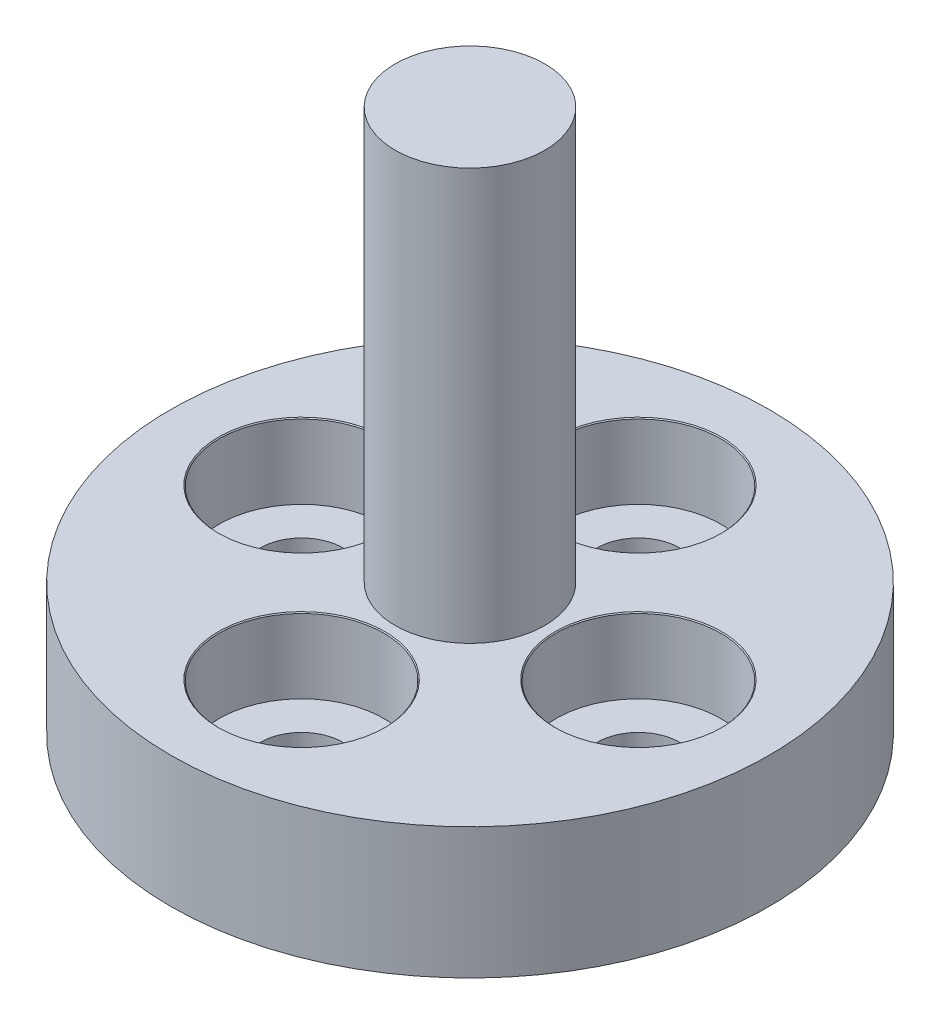
ISO-10303-21;
HEADER;
FILE_DESCRIPTION(('STEP AP214'),'2;1');
FILE_NAME('part.step','',(''),(''),'','','');
FILE_SCHEMA(('AUTOMOTIVE_DESIGN { 1 0 10303 214 1 1 1 1 }'));
ENDSEC;
DATA;
#1=APPLICATION_CONTEXT('core data for automotive mechanical design processes');
#2=APPLICATION_PROTOCOL_DEFINITION('international standard','automotive_design',2000,#1);
#3=PRODUCT_CONTEXT('',#1,'mechanical');
#4=PRODUCT('Part','Part','',(#3));
#5=PRODUCT_RELATED_PRODUCT_CATEGORY('part','',(#4));
#6=PRODUCT_DEFINITION_FORMATION('','',#4);
#7=PRODUCT_DEFINITION_CONTEXT('part definition',#1,'design');
#8=PRODUCT_DEFINITION('design','',#6,#7);
#9=PRODUCT_DEFINITION_SHAPE('','',#8);
#10=(LENGTH_UNIT() NAMED_UNIT(*) SI_UNIT(.MILLI.,.METRE.));
#11=(NAMED_UNIT(*) PLANE_ANGLE_UNIT() SI_UNIT($,.RADIAN.));
#12=(NAMED_UNIT(*) SI_UNIT($,.STERADIAN.) SOLID_ANGLE_UNIT());
#13=UNCERTAINTY_MEASURE_WITH_UNIT(LENGTH_MEASURE(1.E-05),#10,'distance_accuracy_value','');
#14=(GEOMETRIC_REPRESENTATION_CONTEXT(3) GLOBAL_UNCERTAINTY_ASSIGNED_CONTEXT((#13)) GLOBAL_UNIT_ASSIGNED_CONTEXT((#10,
#11,#12)) REPRESENTATION_CONTEXT('',''));
#15=CARTESIAN_POINT('',(0.,0.,0.));
#16=DIRECTION('',(0.,0.,1.));
#17=DIRECTION('',(1.,0.,0.));
#18=AXIS2_PLACEMENT_3D('',#15,#16,#17);
#19=CARTESIAN_POINT('',(8.,0.,0.));
#20=DIRECTION('',(0.,-1.,0.));
#21=DIRECTION('',(0.,0.,-1.));
#22=AXIS2_PLACEMENT_3D('',#19,#20,#21);
#23=PLANE('',#22);
#24=CARTESIAN_POINT('',(0.,0.,-4.5));
#25=DIRECTION('',(0.,1.,0.));
#26=DIRECTION('',(0.,0.,1.));
#27=AXIS2_PLACEMENT_3D('',#24,#25,#26);
#28=CIRCLE('',#27,1.1);
#29=CARTESIAN_POINT('',(0.,0.,-3.4));
#30=VERTEX_POINT('',#29);
#31=EDGE_CURVE('E124',#30,#30,#28,.T.);
#32=ORIENTED_EDGE('',*,*,#31,.T.);
#33=EDGE_LOOP('',(#32));
#34=FACE_BOUND('',#33,.T.);
#35=CARTESIAN_POINT('',(4.5,0.,0.));
#36=DIRECTION('',(0.,1.,0.));
#37=DIRECTION('',(0.,0.,1.));
#38=AXIS2_PLACEMENT_3D('',#35,#36,#37);
#39=CIRCLE('',#38,1.1);
#40=CARTESIAN_POINT('',(4.5,0.,1.1));
#41=VERTEX_POINT('',#40);
#42=EDGE_CURVE('E104',#41,#41,#39,.T.);
#43=ORIENTED_EDGE('',*,*,#42,.T.);
#44=EDGE_LOOP('',(#43));
#45=FACE_BOUND('',#44,.T.);
#46=CARTESIAN_POINT('',(0.,0.,4.5));
#47=DIRECTION('',(0.,1.,0.));
#48=DIRECTION('',(0.,0.,1.));
#49=AXIS2_PLACEMENT_3D('',#46,#47,#48);
#50=CIRCLE('',#49,1.1);
#51=CARTESIAN_POINT('',(0.,0.,5.6));
#52=VERTEX_POINT('',#51);
#53=EDGE_CURVE('E84',#52,#52,#50,.T.);
#54=ORIENTED_EDGE('',*,*,#53,.T.);
#55=EDGE_LOOP('',(#54));
#56=FACE_BOUND('',#55,.T.);
#57=CARTESIAN_POINT('',(-4.5,0.,0.));
#58=DIRECTION('',(0.,1.,0.));
#59=DIRECTION('',(0.,0.,1.));
#60=AXIS2_PLACEMENT_3D('',#57,#58,#59);
#61=CIRCLE('',#60,1.1);
#62=CARTESIAN_POINT('',(-4.5,0.,1.1));
#63=VERTEX_POINT('',#62);
#64=EDGE_CURVE('E64',#63,#63,#61,.T.);
#65=ORIENTED_EDGE('',*,*,#64,.T.);
#66=EDGE_LOOP('',(#65));
#67=FACE_BOUND('',#66,.T.);
#68=CARTESIAN_POINT('',(0.,0.,0.));
#69=DIRECTION('',(0.,-1.,0.));
#70=DIRECTION('',(0.,0.,-1.));
#71=AXIS2_PLACEMENT_3D('',#68,#69,#70);
#72=CIRCLE('',#71,8.);
#73=CARTESIAN_POINT('',(0.,0.,-8.));
#74=VERTEX_POINT('',#73);
#75=EDGE_CURVE('E58',#74,#74,#72,.T.);
#76=ORIENTED_EDGE('',*,*,#75,.T.);
#77=EDGE_LOOP('',(#76));
#78=FACE_BOUND('',#77,.T.);
#79=ADVANCED_FACE('F41',(#34,#45,#56,#67,#78),#23,.T.);
#80=CARTESIAN_POINT('',(0.,14.5,0.));
#81=DIRECTION('',(0.,1.,0.));
#82=DIRECTION('',(0.,0.,1.));
#83=AXIS2_PLACEMENT_3D('',#80,#81,#82);
#84=PLANE('',#83);
#85=CARTESIAN_POINT('',(0.,14.5,0.));
#86=DIRECTION('',(0.,-1.,0.));
#87=DIRECTION('',(0.,0.,-1.));
#88=AXIS2_PLACEMENT_3D('',#85,#86,#87);
#89=CIRCLE('',#88,2.);
#90=CARTESIAN_POINT('',(0.,14.5,-2.));
#91=VERTEX_POINT('',#90);
#92=EDGE_CURVE('E10',#91,#91,#89,.T.);
#93=ORIENTED_EDGE('',*,*,#92,.F.);
#94=EDGE_LOOP('',(#93));
#95=FACE_BOUND('',#94,.T.);
#96=ADVANCED_FACE('F168',(#95),#84,.T.);
#97=CARTESIAN_POINT('',(0.,0.,0.));
#98=DIRECTION('',(0.,-1.,0.));
#99=DIRECTION('',(0.,0.,-1.));
#100=AXIS2_PLACEMENT_3D('',#97,#98,#99);
#101=CYLINDRICAL_SURFACE('',#100,2.);
#102=ORIENTED_EDGE('',*,*,#92,.T.);
#103=EDGE_LOOP('',(#102));
#104=FACE_BOUND('',#103,.T.);
#105=CARTESIAN_POINT('',(0.,3.5,0.));
#106=DIRECTION('',(0.,-1.,0.));
#107=DIRECTION('',(0.,0.,-1.));
#108=AXIS2_PLACEMENT_3D('',#105,#106,#107);
#109=CIRCLE('',#108,2.);
#110=CARTESIAN_POINT('',(0.,3.5,-2.));
#111=VERTEX_POINT('',#110);
#112=EDGE_CURVE('E48',#111,#111,#109,.T.);
#113=ORIENTED_EDGE('',*,*,#112,.F.);
#114=EDGE_LOOP('',(#113));
#115=FACE_BOUND('',#114,.T.);
#116=ADVANCED_FACE('F151',(#104,#115),#101,.T.);
#117=CARTESIAN_POINT('',(2.,3.5,0.));
#118=DIRECTION('',(0.,1.,0.));
#119=DIRECTION('',(0.,0.,1.));
#120=AXIS2_PLACEMENT_3D('',#117,#118,#119);
#121=PLANE('',#120);
#122=CARTESIAN_POINT('',(0.,3.5,-4.5));
#123=DIRECTION('',(0.,1.,0.));
#124=DIRECTION('',(0.,0.,1.));
#125=AXIS2_PLACEMENT_3D('',#122,#123,#124);
#126=CIRCLE('',#125,2.225);
#127=CARTESIAN_POINT('',(0.,3.5,-2.275));
#128=VERTEX_POINT('',#127);
#129=EDGE_CURVE('E140',#128,#128,#126,.T.);
#130=ORIENTED_EDGE('',*,*,#129,.F.);
#131=EDGE_LOOP('',(#130));
#132=FACE_BOUND('',#131,.T.);
#133=CARTESIAN_POINT('',(4.5,3.5,0.));
#134=DIRECTION('',(0.,1.,0.));
#135=DIRECTION('',(0.,0.,1.));
#136=AXIS2_PLACEMENT_3D('',#133,#134,#135);
#137=CIRCLE('',#136,2.225);
#138=CARTESIAN_POINT('',(4.5,3.5,2.225));
#139=VERTEX_POINT('',#138);
#140=EDGE_CURVE('E120',#139,#139,#137,.T.);
#141=ORIENTED_EDGE('',*,*,#140,.F.);
#142=EDGE_LOOP('',(#141));
#143=FACE_BOUND('',#142,.T.);
#144=CARTESIAN_POINT('',(0.,3.5,4.5));
#145=DIRECTION('',(0.,1.,0.));
#146=DIRECTION('',(0.,0.,1.));
#147=AXIS2_PLACEMENT_3D('',#144,#145,#146);
#148=CIRCLE('',#147,2.225);
#149=CARTESIAN_POINT('',(0.,3.5,6.725));
#150=VERTEX_POINT('',#149);
#151=EDGE_CURVE('E100',#150,#150,#148,.T.);
#152=ORIENTED_EDGE('',*,*,#151,.F.);
#153=EDGE_LOOP('',(#152));
#154=FACE_BOUND('',#153,.T.);
#155=CARTESIAN_POINT('',(-4.5,3.5,0.));
#156=DIRECTION('',(0.,1.,0.));
#157=DIRECTION('',(0.,0.,1.));
#158=AXIS2_PLACEMENT_3D('',#155,#156,#157);
#159=CIRCLE('',#158,2.225);
#160=CARTESIAN_POINT('',(-4.5,3.5,2.225));
#161=VERTEX_POINT('',#160);
#162=EDGE_CURVE('E80',#161,#161,#159,.T.);
#163=ORIENTED_EDGE('',*,*,#162,.F.);
#164=EDGE_LOOP('',(#163));
#165=FACE_BOUND('',#164,.T.);
#166=ORIENTED_EDGE('',*,*,#112,.T.);
#167=EDGE_LOOP('',(#166));
#168=FACE_BOUND('',#167,.T.);
#169=CARTESIAN_POINT('',(0.,3.5,0.));
#170=DIRECTION('',(0.,-1.,0.));
#171=DIRECTION('',(0.,0.,-1.));
#172=AXIS2_PLACEMENT_3D('',#169,#170,#171);
#173=CIRCLE('',#172,8.);
#174=CARTESIAN_POINT('',(0.,3.5,-8.));
#175=VERTEX_POINT('',#174);
#176=EDGE_CURVE('E53',#175,#175,#173,.T.);
#177=ORIENTED_EDGE('',*,*,#176,.F.);
#178=EDGE_LOOP('',(#177));
#179=FACE_BOUND('',#178,.T.);
#180=ADVANCED_FACE('F147',(#132,#143,#154,#165,#168,#179),#121,.T.);
#181=CARTESIAN_POINT('',(0.,0.,0.));
#182=DIRECTION('',(0.,-1.,0.));
#183=DIRECTION('',(0.,0.,-1.));
#184=AXIS2_PLACEMENT_3D('',#181,#182,#183);
#185=CYLINDRICAL_SURFACE('',#184,8.);
#186=ORIENTED_EDGE('',*,*,#176,.T.);
#187=EDGE_LOOP('',(#186));
#188=FACE_BOUND('',#187,.T.);
#189=ORIENTED_EDGE('',*,*,#75,.F.);
#190=EDGE_LOOP('',(#189));
#191=FACE_BOUND('',#190,.T.);
#192=ADVANCED_FACE('F150',(#188,#191),#185,.T.);
#193=CARTESIAN_POINT('',(-4.5,3.5,0.));
#194=DIRECTION('',(0.,1.,0.));
#195=DIRECTION('',(0.,0.,1.));
#196=AXIS2_PLACEMENT_3D('',#193,#194,#195);
#197=CYLINDRICAL_SURFACE('',#196,1.1);
#198=ORIENTED_EDGE('',*,*,#64,.F.);
#199=EDGE_LOOP('',(#198));
#200=FACE_BOUND('',#199,.T.);
#201=CARTESIAN_POINT('',(-4.5,1.5,0.));
#202=DIRECTION('',(0.,1.,0.));
#203=DIRECTION('',(0.,0.,1.));
#204=AXIS2_PLACEMENT_3D('',#201,#202,#203);
#205=CIRCLE('',#204,1.1);
#206=CARTESIAN_POINT('',(-4.5,1.5,1.1));
#207=VERTEX_POINT('',#206);
#208=EDGE_CURVE('E68',#207,#207,#205,.T.);
#209=ORIENTED_EDGE('',*,*,#208,.T.);
#210=EDGE_LOOP('',(#209));
#211=FACE_BOUND('',#210,.T.);
#212=ADVANCED_FACE('F163',(#200,#211),#197,.F.);
#213=CARTESIAN_POINT('',(-2.3,1.5,0.));
#214=DIRECTION('',(0.,-1.,0.));
#215=DIRECTION('',(0.,0.,-1.));
#216=AXIS2_PLACEMENT_3D('',#213,#214,#215);
#217=PLANE('',#216);
#218=ORIENTED_EDGE('',*,*,#208,.F.);
#219=EDGE_LOOP('',(#218));
#220=FACE_BOUND('',#219,.T.);
#221=CARTESIAN_POINT('',(-4.5,1.5,0.));
#222=DIRECTION('',(0.,1.,0.));
#223=DIRECTION('',(0.,0.,1.));
#224=AXIS2_PLACEMENT_3D('',#221,#222,#223);
#225=CIRCLE('',#224,2.2);
#226=CARTESIAN_POINT('',(-4.5,1.5,2.2));
#227=VERTEX_POINT('',#226);
#228=EDGE_CURVE('E72',#227,#227,#225,.T.);
#229=ORIENTED_EDGE('',*,*,#228,.T.);
#230=EDGE_LOOP('',(#229));
#231=FACE_BOUND('',#230,.T.);
#232=ADVANCED_FACE('F184',(#220,#231),#217,.F.);
#233=CARTESIAN_POINT('',(-4.5,3.5,0.));
#234=DIRECTION('',(0.,1.,0.));
#235=DIRECTION('',(0.,0.,1.));
#236=AXIS2_PLACEMENT_3D('',#233,#234,#235);
#237=CYLINDRICAL_SURFACE('',#236,2.2);
#238=ORIENTED_EDGE('',*,*,#228,.F.);
#239=EDGE_LOOP('',(#238));
#240=FACE_BOUND('',#239,.T.);
#241=CARTESIAN_POINT('',(-4.5,3.475,0.));
#242=DIRECTION('',(0.,1.,0.));
#243=DIRECTION('',(0.,0.,1.));
#244=AXIS2_PLACEMENT_3D('',#241,#242,#243);
#245=CIRCLE('',#244,2.2);
#246=CARTESIAN_POINT('',(-4.5,3.475,2.2));
#247=VERTEX_POINT('',#246);
#248=EDGE_CURVE('E76',#247,#247,#245,.T.);
#249=ORIENTED_EDGE('',*,*,#248,.T.);
#250=EDGE_LOOP('',(#249));
#251=FACE_BOUND('',#250,.T.);
#252=ADVANCED_FACE('F190',(#240,#251),#237,.F.);
#253=CARTESIAN_POINT('',(-4.5,3.5,0.));
#254=DIRECTION('',(0.,1.,0.));
#255=DIRECTION('',(0.,0.,1.));
#256=AXIS2_PLACEMENT_3D('',#253,#254,#255);
#257=CONICAL_SURFACE('',#256,2.225,0.785398163397405);
#258=ORIENTED_EDGE('',*,*,#248,.F.);
#259=EDGE_LOOP('',(#258));
#260=FACE_BOUND('',#259,.T.);
#261=ORIENTED_EDGE('',*,*,#162,.T.);
#262=EDGE_LOOP('',(#261));
#263=FACE_BOUND('',#262,.T.);
#264=ADVANCED_FACE('F196',(#260,#263),#257,.F.);
#265=CARTESIAN_POINT('',(0.,3.5,4.5));
#266=DIRECTION('',(0.,1.,0.));
#267=DIRECTION('',(0.,0.,1.));
#268=AXIS2_PLACEMENT_3D('',#265,#266,#267);
#269=CYLINDRICAL_SURFACE('',#268,1.1);
#270=ORIENTED_EDGE('',*,*,#53,.F.);
#271=EDGE_LOOP('',(#270));
#272=FACE_BOUND('',#271,.T.);
#273=CARTESIAN_POINT('',(0.,1.5,4.5));
#274=DIRECTION('',(0.,1.,0.));
#275=DIRECTION('',(0.,0.,1.));
#276=AXIS2_PLACEMENT_3D('',#273,#274,#275);
#277=CIRCLE('',#276,1.1);
#278=CARTESIAN_POINT('',(0.,1.5,5.6));
#279=VERTEX_POINT('',#278);
#280=EDGE_CURVE('E88',#279,#279,#277,.T.);
#281=ORIENTED_EDGE('',*,*,#280,.T.);
#282=EDGE_LOOP('',(#281));
#283=FACE_BOUND('',#282,.T.);
#284=ADVANCED_FACE('F202',(#272,#283),#269,.F.);
#285=CARTESIAN_POINT('',(2.2,1.5,4.5));
#286=DIRECTION('',(0.,-1.,0.));
#287=DIRECTION('',(0.,0.,-1.));
#288=AXIS2_PLACEMENT_3D('',#285,#286,#287);
#289=PLANE('',#288);
#290=ORIENTED_EDGE('',*,*,#280,.F.);
#291=EDGE_LOOP('',(#290));
#292=FACE_BOUND('',#291,.T.);
#293=CARTESIAN_POINT('',(0.,1.5,4.5));
#294=DIRECTION('',(0.,1.,0.));
#295=DIRECTION('',(0.,0.,1.));
#296=AXIS2_PLACEMENT_3D('',#293,#294,#295);
#297=CIRCLE('',#296,2.2);
#298=CARTESIAN_POINT('',(0.,1.5,6.7));
#299=VERTEX_POINT('',#298);
#300=EDGE_CURVE('E92',#299,#299,#297,.T.);
#301=ORIENTED_EDGE('',*,*,#300,.T.);
#302=EDGE_LOOP('',(#301));
#303=FACE_BOUND('',#302,.T.);
#304=ADVANCED_FACE('F207',(#292,#303),#289,.F.);
#305=CARTESIAN_POINT('',(0.,3.5,4.5));
#306=DIRECTION('',(0.,1.,0.));
#307=DIRECTION('',(0.,0.,1.));
#308=AXIS2_PLACEMENT_3D('',#305,#306,#307);
#309=CYLINDRICAL_SURFACE('',#308,2.2);
#310=ORIENTED_EDGE('',*,*,#300,.F.);
#311=EDGE_LOOP('',(#310));
#312=FACE_BOUND('',#311,.T.);
#313=CARTESIAN_POINT('',(0.,3.475,4.5));
#314=DIRECTION('',(0.,1.,0.));
#315=DIRECTION('',(0.,0.,1.));
#316=AXIS2_PLACEMENT_3D('',#313,#314,#315);
#317=CIRCLE('',#316,2.2);
#318=CARTESIAN_POINT('',(0.,3.475,6.7));
#319=VERTEX_POINT('',#318);
#320=EDGE_CURVE('E96',#319,#319,#317,.T.);
#321=ORIENTED_EDGE('',*,*,#320,.T.);
#322=EDGE_LOOP('',(#321));
#323=FACE_BOUND('',#322,.T.);
#324=ADVANCED_FACE('F260',(#312,#323),#309,.F.);
#325=CARTESIAN_POINT('',(0.,3.5,4.5));
#326=DIRECTION('',(0.,1.,0.));
#327=DIRECTION('',(0.,0.,1.));
#328=AXIS2_PLACEMENT_3D('',#325,#326,#327);
#329=CONICAL_SURFACE('',#328,2.225,0.785398163397405);
#330=ORIENTED_EDGE('',*,*,#320,.F.);
#331=EDGE_LOOP('',(#330));
#332=FACE_BOUND('',#331,.T.);
#333=ORIENTED_EDGE('',*,*,#151,.T.);
#334=EDGE_LOOP('',(#333));
#335=FACE_BOUND('',#334,.T.);
#336=ADVANCED_FACE('F270',(#332,#335),#329,.F.);
#337=CARTESIAN_POINT('',(4.5,3.5,0.));
#338=DIRECTION('',(0.,1.,0.));
#339=DIRECTION('',(0.,0.,1.));
#340=AXIS2_PLACEMENT_3D('',#337,#338,#339);
#341=CYLINDRICAL_SURFACE('',#340,1.1);
#342=ORIENTED_EDGE('',*,*,#42,.F.);
#343=EDGE_LOOP('',(#342));
#344=FACE_BOUND('',#343,.T.);
#345=CARTESIAN_POINT('',(4.5,1.5,0.));
#346=DIRECTION('',(0.,1.,0.));
#347=DIRECTION('',(0.,0.,1.));
#348=AXIS2_PLACEMENT_3D('',#345,#346,#347);
#349=CIRCLE('',#348,1.1);
#350=CARTESIAN_POINT('',(4.5,1.5,1.1));
#351=VERTEX_POINT('',#350);
#352=EDGE_CURVE('E108',#351,#351,#349,.T.);
#353=ORIENTED_EDGE('',*,*,#352,.T.);
#354=EDGE_LOOP('',(#353));
#355=FACE_BOUND('',#354,.T.);
#356=ADVANCED_FACE('F281',(#344,#355),#341,.F.);
#357=CARTESIAN_POINT('',(6.7,1.5,0.));
#358=DIRECTION('',(0.,-1.,0.));
#359=DIRECTION('',(0.,0.,-1.));
#360=AXIS2_PLACEMENT_3D('',#357,#358,#359);
#361=PLANE('',#360);
#362=ORIENTED_EDGE('',*,*,#352,.F.);
#363=EDGE_LOOP('',(#362));
#364=FACE_BOUND('',#363,.T.);
#365=CARTESIAN_POINT('',(4.5,1.5,0.));
#366=DIRECTION('',(0.,1.,0.));
#367=DIRECTION('',(0.,0.,1.));
#368=AXIS2_PLACEMENT_3D('',#365,#366,#367);
#369=CIRCLE('',#368,2.2);
#370=CARTESIAN_POINT('',(4.5,1.5,2.2));
#371=VERTEX_POINT('',#370);
#372=EDGE_CURVE('E112',#371,#371,#369,.T.);
#373=ORIENTED_EDGE('',*,*,#372,.T.);
#374=EDGE_LOOP('',(#373));
#375=FACE_BOUND('',#374,.T.);
#376=ADVANCED_FACE('F292',(#364,#375),#361,.F.);
#377=CARTESIAN_POINT('',(4.5,3.5,0.));
#378=DIRECTION('',(0.,1.,0.));
#379=DIRECTION('',(0.,0.,1.));
#380=AXIS2_PLACEMENT_3D('',#377,#378,#379);
#381=CYLINDRICAL_SURFACE('',#380,2.2);
#382=ORIENTED_EDGE('',*,*,#372,.F.);
#383=EDGE_LOOP('',(#382));
#384=FACE_BOUND('',#383,.T.);
#385=CARTESIAN_POINT('',(4.5,3.475,0.));
#386=DIRECTION('',(0.,1.,0.));
#387=DIRECTION('',(0.,0.,1.));
#388=AXIS2_PLACEMENT_3D('',#385,#386,#387);
#389=CIRCLE('',#388,2.2);
#390=CARTESIAN_POINT('',(4.5,3.475,2.2));
#391=VERTEX_POINT('',#390);
#392=EDGE_CURVE('E116',#391,#391,#389,.T.);
#393=ORIENTED_EDGE('',*,*,#392,.T.);
#394=EDGE_LOOP('',(#393));
#395=FACE_BOUND('',#394,.T.);
#396=ADVANCED_FACE('F303',(#384,#395),#381,.F.);
#397=CARTESIAN_POINT('',(4.5,3.5,0.));
#398=DIRECTION('',(0.,1.,0.));
#399=DIRECTION('',(0.,0.,1.));
#400=AXIS2_PLACEMENT_3D('',#397,#398,#399);
#401=CONICAL_SURFACE('',#400,2.225,0.785398163397396);
#402=ORIENTED_EDGE('',*,*,#392,.F.);
#403=EDGE_LOOP('',(#402));
#404=FACE_BOUND('',#403,.T.);
#405=ORIENTED_EDGE('',*,*,#140,.T.);
#406=EDGE_LOOP('',(#405));
#407=FACE_BOUND('',#406,.T.);
#408=ADVANCED_FACE('F314',(#404,#407),#401,.F.);
#409=CARTESIAN_POINT('',(0.,3.5,-4.5));
#410=DIRECTION('',(0.,1.,0.));
#411=DIRECTION('',(0.,0.,1.));
#412=AXIS2_PLACEMENT_3D('',#409,#410,#411);
#413=CYLINDRICAL_SURFACE('',#412,1.1);
#414=ORIENTED_EDGE('',*,*,#31,.F.);
#415=EDGE_LOOP('',(#414));
#416=FACE_BOUND('',#415,.T.);
#417=CARTESIAN_POINT('',(0.,1.5,-4.5));
#418=DIRECTION('',(0.,1.,0.));
#419=DIRECTION('',(0.,0.,1.));
#420=AXIS2_PLACEMENT_3D('',#417,#418,#419);
#421=CIRCLE('',#420,1.1);
#422=CARTESIAN_POINT('',(0.,1.5,-3.4));
#423=VERTEX_POINT('',#422);
#424=EDGE_CURVE('E128',#423,#423,#421,.T.);
#425=ORIENTED_EDGE('',*,*,#424,.T.);
#426=EDGE_LOOP('',(#425));
#427=FACE_BOUND('',#426,.T.);
#428=ADVANCED_FACE('F325',(#416,#427),#413,.F.);
#429=CARTESIAN_POINT('',(2.2,1.5,-4.5));
#430=DIRECTION('',(0.,-1.,0.));
#431=DIRECTION('',(0.,0.,-1.));
#432=AXIS2_PLACEMENT_3D('',#429,#430,#431);
#433=PLANE('',#432);
#434=ORIENTED_EDGE('',*,*,#424,.F.);
#435=EDGE_LOOP('',(#434));
#436=FACE_BOUND('',#435,.T.);
#437=CARTESIAN_POINT('',(0.,1.5,-4.5));
#438=DIRECTION('',(0.,1.,0.));
#439=DIRECTION('',(0.,0.,1.));
#440=AXIS2_PLACEMENT_3D('',#437,#438,#439);
#441=CIRCLE('',#440,2.2);
#442=CARTESIAN_POINT('',(0.,1.5,-2.3));
#443=VERTEX_POINT('',#442);
#444=EDGE_CURVE('E132',#443,#443,#441,.T.);
#445=ORIENTED_EDGE('',*,*,#444,.T.);
#446=EDGE_LOOP('',(#445));
#447=FACE_BOUND('',#446,.T.);
#448=ADVANCED_FACE('F336',(#436,#447),#433,.F.);
#449=CARTESIAN_POINT('',(0.,3.5,-4.5));
#450=DIRECTION('',(0.,1.,0.));
#451=DIRECTION('',(0.,0.,1.));
#452=AXIS2_PLACEMENT_3D('',#449,#450,#451);
#453=CYLINDRICAL_SURFACE('',#452,2.2);
#454=ORIENTED_EDGE('',*,*,#444,.F.);
#455=EDGE_LOOP('',(#454));
#456=FACE_BOUND('',#455,.T.);
#457=CARTESIAN_POINT('',(0.,3.475,-4.5));
#458=DIRECTION('',(0.,1.,0.));
#459=DIRECTION('',(0.,0.,1.));
#460=AXIS2_PLACEMENT_3D('',#457,#458,#459);
#461=CIRCLE('',#460,2.2);
#462=CARTESIAN_POINT('',(0.,3.475,-2.3));
#463=VERTEX_POINT('',#462);
#464=EDGE_CURVE('E136',#463,#463,#461,.T.);
#465=ORIENTED_EDGE('',*,*,#464,.T.);
#466=EDGE_LOOP('',(#465));
#467=FACE_BOUND('',#466,.T.);
#468=ADVANCED_FACE('F347',(#456,#467),#453,.F.);
#469=CARTESIAN_POINT('',(0.,3.5,-4.5));
#470=DIRECTION('',(0.,1.,0.));
#471=DIRECTION('',(0.,0.,1.));
#472=AXIS2_PLACEMENT_3D('',#469,#470,#471);
#473=CONICAL_SURFACE('',#472,2.225,0.785398163397405);
#474=ORIENTED_EDGE('',*,*,#464,.F.);
#475=EDGE_LOOP('',(#474));
#476=FACE_BOUND('',#475,.T.);
#477=ORIENTED_EDGE('',*,*,#129,.T.);
#478=EDGE_LOOP('',(#477));
#479=FACE_BOUND('',#478,.T.);
#480=ADVANCED_FACE('F145',(#476,#479),#473,.F.);
#481=CLOSED_SHELL('',(#79,#96,#116,#180,#192,#212,#232,#252,#264,#284,#304,#324,#336,#356,#376,
#396,#408,#428,#448,#468,#480));
#482=MANIFOLD_SOLID_BREP('B2',#481);
#483=ADVANCED_BREP_SHAPE_REPRESENTATION('',(#18,#482),#14);
#484=SHAPE_DEFINITION_REPRESENTATION(#9,#483);
ENDSEC;
END-ISO-10303-21;
